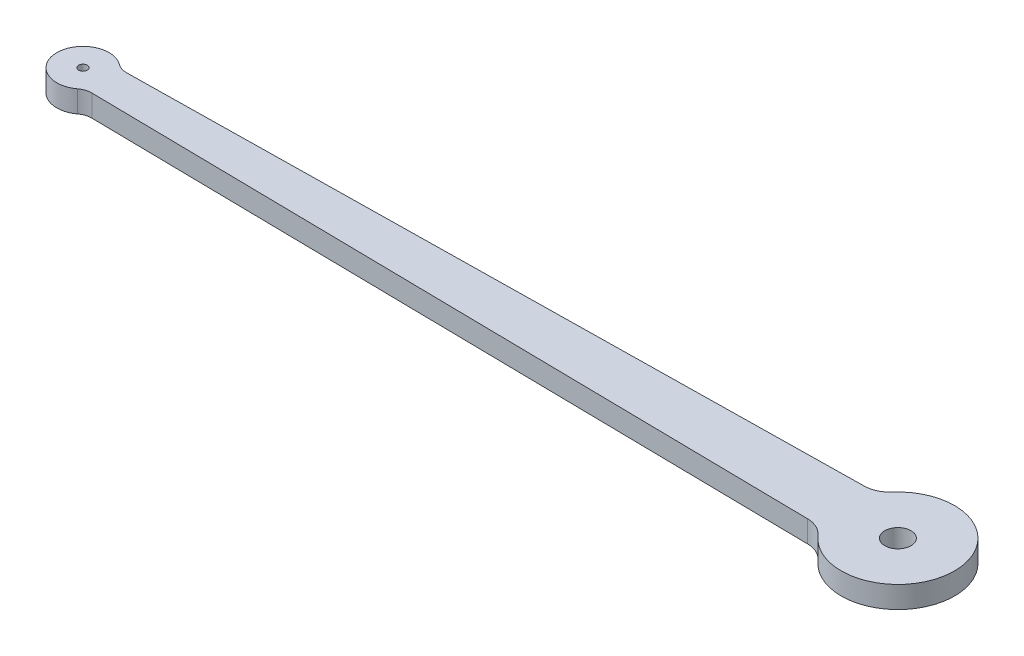
ISO-10303-21;
HEADER;
FILE_DESCRIPTION(('STEP AP214'),'2;1');
FILE_NAME('part.step','',(''),(''),'','','');
FILE_SCHEMA(('AUTOMOTIVE_DESIGN { 1 0 10303 214 1 1 1 1 }'));
ENDSEC;
DATA;
#1=APPLICATION_CONTEXT('core data for automotive mechanical design processes');
#2=APPLICATION_PROTOCOL_DEFINITION('international standard','automotive_design',2000,#1);
#3=PRODUCT_CONTEXT('',#1,'mechanical');
#4=PRODUCT('Part','Part','',(#3));
#5=PRODUCT_RELATED_PRODUCT_CATEGORY('part','',(#4));
#6=PRODUCT_DEFINITION_FORMATION('','',#4);
#7=PRODUCT_DEFINITION_CONTEXT('part definition',#1,'design');
#8=PRODUCT_DEFINITION('design','',#6,#7);
#9=PRODUCT_DEFINITION_SHAPE('','',#8);
#10=(LENGTH_UNIT() NAMED_UNIT(*) SI_UNIT(.MILLI.,.METRE.));
#11=(NAMED_UNIT(*) PLANE_ANGLE_UNIT() SI_UNIT($,.RADIAN.));
#12=(NAMED_UNIT(*) SI_UNIT($,.STERADIAN.) SOLID_ANGLE_UNIT());
#13=UNCERTAINTY_MEASURE_WITH_UNIT(LENGTH_MEASURE(1.E-05),#10,'distance_accuracy_value','');
#14=(GEOMETRIC_REPRESENTATION_CONTEXT(3) GLOBAL_UNCERTAINTY_ASSIGNED_CONTEXT((#13)) GLOBAL_UNIT_ASSIGNED_CONTEXT((#10,
#11,#12)) REPRESENTATION_CONTEXT('',''));
#15=CARTESIAN_POINT('',(0.,0.,0.));
#16=DIRECTION('',(0.,0.,1.));
#17=DIRECTION('',(1.,0.,0.));
#18=AXIS2_PLACEMENT_3D('',#15,#16,#17);
#19=CARTESIAN_POINT('',(39.5951614105319,2.5,-6.24966277159476));
#20=DIRECTION('',(0.,-1.,0.));
#21=DIRECTION('',(0.,0.,-1.));
#22=AXIS2_PLACEMENT_3D('',#19,#20,#21);
#23=CYLINDRICAL_SURFACE('',#22,3.);
#24=CARTESIAN_POINT('',(39.5951614105319,0.,-6.24966277159476));
#25=DIRECTION('',(0.,-1.,0.));
#26=DIRECTION('',(0.,0.,1.));
#27=AXIS2_PLACEMENT_3D('',#24,#25,#26);
#28=CIRCLE('',#27,3.);
#29=CARTESIAN_POINT('',(41.8545841229955,0.,-4.27608505424905));
#30=VERTEX_POINT('',#29);
#31=CARTESIAN_POINT('',(39.6401420364545,0.,-3.25));
#32=VERTEX_POINT('',#31);
#33=EDGE_CURVE('E130',#30,#32,#28,.T.);
#34=ORIENTED_EDGE('',*,*,#33,.T.);
#35=DIRECTION('',(0.,-1.,0.));
#36=VECTOR('',#35,1.);
#37=CARTESIAN_POINT('',(39.6401420364545,2.5,-3.25));
#38=LINE('',#37,#36);
#39=CARTESIAN_POINT('',(39.6401420364545,2.5,-3.25));
#40=VERTEX_POINT('',#39);
#41=EDGE_CURVE('E11',#40,#32,#38,.T.);
#42=ORIENTED_EDGE('',*,*,#41,.F.);
#43=CARTESIAN_POINT('',(39.5951614105319,2.5,-6.24966277159476));
#44=DIRECTION('',(0.,-1.,0.));
#45=DIRECTION('',(0.,0.,1.));
#46=AXIS2_PLACEMENT_3D('',#43,#44,#45);
#47=CIRCLE('',#46,3.);
#48=CARTESIAN_POINT('',(41.8545841229955,2.5,-4.27608505424905));
#49=VERTEX_POINT('',#48);
#50=EDGE_CURVE('E145',#49,#40,#47,.T.);
#51=ORIENTED_EDGE('',*,*,#50,.F.);
#52=DIRECTION('',(0.,-1.,0.));
#53=VECTOR('',#52,1.);
#54=CARTESIAN_POINT('',(41.8545841229955,2.5,-4.27608505424905));
#55=LINE('',#54,#53);
#56=EDGE_CURVE('E126',#49,#30,#55,.T.);
#57=ORIENTED_EDGE('',*,*,#56,.T.);
#58=EDGE_LOOP('',(#34,#42,#51,#57));
#59=FACE_BOUND('',#58,.T.);
#60=ADVANCED_FACE('F34',(#59),#23,.F.);
#61=CARTESIAN_POINT('',(39.6401420364545,2.5,-3.25));
#62=DIRECTION('',(0.0149935419742022,0.,0.99988759053159));
#63=DIRECTION('',(0.99988759053159,0.,-0.0149935419742022));
#64=AXIS2_PLACEMENT_3D('',#61,#62,#63);
#65=PLANE('',#64);
#66=DIRECTION('',(-0.99988759053159,0.,0.0149935419742022));
#67=VECTOR('',#66,1.);
#68=CARTESIAN_POINT('',(39.6401420364545,0.,-3.25));
#69=LINE('',#68,#67);
#70=CARTESIAN_POINT('',(-43.7197131808668,0.,-2.00000000000016));
#71=VERTEX_POINT('',#70);
#72=EDGE_CURVE('E133',#32,#71,#69,.T.);
#73=ORIENTED_EDGE('',*,*,#72,.T.);
#74=DIRECTION('',(0.,-1.,0.));
#75=VECTOR('',#74,1.);
#76=CARTESIAN_POINT('',(-43.7197131808668,2.5,-2.00000000000016));
#77=LINE('',#76,#75);
#78=CARTESIAN_POINT('',(-43.7197131808668,2.5,-2.00000000000016));
#79=VERTEX_POINT('',#78);
#80=EDGE_CURVE('E42',#79,#71,#77,.T.);
#81=ORIENTED_EDGE('',*,*,#80,.F.);
#82=DIRECTION('',(-0.99988759053159,0.,0.0149935419742022));
#83=VECTOR('',#82,1.);
#84=CARTESIAN_POINT('',(39.6401420364545,2.5,-3.25));
#85=LINE('',#84,#83);
#86=EDGE_CURVE('E93',#40,#79,#85,.T.);
#87=ORIENTED_EDGE('',*,*,#86,.F.);
#88=ORIENTED_EDGE('',*,*,#41,.T.);
#89=EDGE_LOOP('',(#73,#81,#87,#88));
#90=FACE_BOUND('',#89,.T.);
#91=ADVANCED_FACE('F213',(#90),#65,.F.);
#92=CARTESIAN_POINT('',(-43.7497002648152,2.5,-3.99977518106334));
#93=DIRECTION('',(0.,-1.,0.));
#94=DIRECTION('',(0.,0.,-1.));
#95=AXIS2_PLACEMENT_3D('',#92,#93,#94);
#96=CYLINDRICAL_SURFACE('',#95,2.);
#97=CARTESIAN_POINT('',(-43.7497002648152,0.,-3.99977518106334));
#98=DIRECTION('',(0.,-1.,0.));
#99=DIRECTION('',(0.,0.,-1.));
#100=AXIS2_PLACEMENT_3D('',#97,#98,#99);
#101=CIRCLE('',#100,2.);
#102=CARTESIAN_POINT('',(-44.9498201588891,0.,-2.399865108638));
#103=VERTEX_POINT('',#102);
#104=EDGE_CURVE('E136',#71,#103,#101,.T.);
#105=ORIENTED_EDGE('',*,*,#104,.T.);
#106=DIRECTION('',(0.,-1.,0.));
#107=VECTOR('',#106,1.);
#108=CARTESIAN_POINT('',(-44.9498201588891,2.5,-2.399865108638));
#109=LINE('',#108,#107);
#110=CARTESIAN_POINT('',(-44.9498201588891,2.5,-2.399865108638));
#111=VERTEX_POINT('',#110);
#112=EDGE_CURVE('E152',#111,#103,#109,.T.);
#113=ORIENTED_EDGE('',*,*,#112,.F.);
#114=CARTESIAN_POINT('',(-43.7497002648152,2.5,-3.99977518106334));
#115=DIRECTION('',(0.,-1.,0.));
#116=DIRECTION('',(0.,0.,-1.));
#117=AXIS2_PLACEMENT_3D('',#114,#115,#116);
#118=CIRCLE('',#117,2.);
#119=EDGE_CURVE('E160',#79,#111,#118,.T.);
#120=ORIENTED_EDGE('',*,*,#119,.F.);
#121=ORIENTED_EDGE('',*,*,#80,.T.);
#122=EDGE_LOOP('',(#105,#113,#120,#121));
#123=FACE_BOUND('',#122,.T.);
#124=ADVANCED_FACE('F158',(#123),#96,.F.);
#125=CARTESIAN_POINT('',(-46.75,2.5,0.));
#126=DIRECTION('',(0.,-1.,0.));
#127=DIRECTION('',(0.,0.,-1.));
#128=AXIS2_PLACEMENT_3D('',#125,#126,#127);
#129=CYLINDRICAL_SURFACE('',#128,3.);
#130=CARTESIAN_POINT('',(-46.75,0.,0.));
#131=DIRECTION('',(0.,1.,0.));
#132=DIRECTION('',(0.,0.,1.));
#133=AXIS2_PLACEMENT_3D('',#130,#131,#132);
#134=CIRCLE('',#133,3.);
#135=CARTESIAN_POINT('',(-44.9498201588891,0.,2.39986510863801));
#136=VERTEX_POINT('',#135);
#137=EDGE_CURVE('E138',#103,#136,#134,.T.);
#138=ORIENTED_EDGE('',*,*,#137,.T.);
#139=DIRECTION('',(0.,-1.,0.));
#140=VECTOR('',#139,1.);
#141=CARTESIAN_POINT('',(-44.9498201588891,2.5,2.39986510863801));
#142=LINE('',#141,#140);
#143=CARTESIAN_POINT('',(-44.9498201588891,2.5,2.39986510863801));
#144=VERTEX_POINT('',#143);
#145=EDGE_CURVE('E149',#144,#136,#142,.T.);
#146=ORIENTED_EDGE('',*,*,#145,.F.);
#147=CARTESIAN_POINT('',(-46.75,2.5,0.));
#148=DIRECTION('',(0.,1.,0.));
#149=DIRECTION('',(0.,0.,1.));
#150=AXIS2_PLACEMENT_3D('',#147,#148,#149);
#151=CIRCLE('',#150,3.);
#152=EDGE_CURVE('E172',#111,#144,#151,.T.);
#153=ORIENTED_EDGE('',*,*,#152,.F.);
#154=ORIENTED_EDGE('',*,*,#112,.T.);
#155=EDGE_LOOP('',(#138,#146,#153,#154));
#156=FACE_BOUND('',#155,.T.);
#157=ADVANCED_FACE('F168',(#156),#129,.T.);
#158=CARTESIAN_POINT('',(-43.7497002648152,2.5,3.99977518106334));
#159=DIRECTION('',(0.,-1.,0.));
#160=DIRECTION('',(0.,0.,-1.));
#161=AXIS2_PLACEMENT_3D('',#158,#159,#160);
#162=CYLINDRICAL_SURFACE('',#161,2.);
#163=CARTESIAN_POINT('',(-43.7497002648152,0.,3.99977518106334));
#164=DIRECTION('',(0.,-1.,0.));
#165=DIRECTION('',(0.,0.,1.));
#166=AXIS2_PLACEMENT_3D('',#163,#164,#165);
#167=CIRCLE('',#166,2.);
#168=CARTESIAN_POINT('',(-43.7197131808668,0.,2.00000000000016));
#169=VERTEX_POINT('',#168);
#170=EDGE_CURVE('E140',#136,#169,#167,.T.);
#171=ORIENTED_EDGE('',*,*,#170,.T.);
#172=DIRECTION('',(0.,-1.,0.));
#173=VECTOR('',#172,1.);
#174=CARTESIAN_POINT('',(-43.7197131808668,2.5,2.00000000000016));
#175=LINE('',#174,#173);
#176=CARTESIAN_POINT('',(-43.7197131808668,2.5,2.00000000000016));
#177=VERTEX_POINT('',#176);
#178=EDGE_CURVE('E121',#177,#169,#175,.T.);
#179=ORIENTED_EDGE('',*,*,#178,.F.);
#180=CARTESIAN_POINT('',(-43.7497002648152,2.5,3.99977518106334));
#181=DIRECTION('',(0.,-1.,0.));
#182=DIRECTION('',(0.,0.,1.));
#183=AXIS2_PLACEMENT_3D('',#180,#181,#182);
#184=CIRCLE('',#183,2.);
#185=EDGE_CURVE('E112',#144,#177,#184,.T.);
#186=ORIENTED_EDGE('',*,*,#185,.F.);
#187=ORIENTED_EDGE('',*,*,#145,.T.);
#188=EDGE_LOOP('',(#171,#179,#186,#187));
#189=FACE_BOUND('',#188,.T.);
#190=ADVANCED_FACE('F171',(#189),#162,.F.);
#191=CARTESIAN_POINT('',(39.6401420364545,2.5,3.24999999999999));
#192=DIRECTION('',(0.0149935419742021,0.,-0.99988759053159));
#193=DIRECTION('',(-0.99988759053159,0.,-0.0149935419742021));
#194=AXIS2_PLACEMENT_3D('',#191,#192,#193);
#195=PLANE('',#194);
#196=DIRECTION('',(0.99988759053159,0.,0.0149935419742021));
#197=VECTOR('',#196,1.);
#198=CARTESIAN_POINT('',(39.6401420364545,0.,3.24999999999999));
#199=LINE('',#198,#197);
#200=CARTESIAN_POINT('',(39.6401420364545,0.,3.24999999999999));
#201=VERTEX_POINT('',#200);
#202=EDGE_CURVE('E120',#169,#201,#199,.T.);
#203=ORIENTED_EDGE('',*,*,#202,.T.);
#204=DIRECTION('',(0.,-1.,0.));
#205=VECTOR('',#204,1.);
#206=CARTESIAN_POINT('',(39.6401420364545,2.5,3.24999999999999));
#207=LINE('',#206,#205);
#208=CARTESIAN_POINT('',(39.6401420364545,2.5,3.24999999999999));
#209=VERTEX_POINT('',#208);
#210=EDGE_CURVE('E117',#209,#201,#207,.T.);
#211=ORIENTED_EDGE('',*,*,#210,.F.);
#212=DIRECTION('',(0.99988759053159,0.,0.0149935419742021));
#213=VECTOR('',#212,1.);
#214=CARTESIAN_POINT('',(39.6401420364545,2.5,3.24999999999999));
#215=LINE('',#214,#213);
#216=EDGE_CURVE('E106',#177,#209,#215,.T.);
#217=ORIENTED_EDGE('',*,*,#216,.F.);
#218=ORIENTED_EDGE('',*,*,#178,.T.);
#219=EDGE_LOOP('',(#203,#211,#217,#218));
#220=FACE_BOUND('',#219,.T.);
#221=ADVANCED_FACE('F118',(#220),#195,.F.);
#222=CARTESIAN_POINT('',(39.5951614105319,2.5,6.24966277159476));
#223=DIRECTION('',(0.,-1.,0.));
#224=DIRECTION('',(0.,0.,-1.));
#225=AXIS2_PLACEMENT_3D('',#222,#223,#224);
#226=CYLINDRICAL_SURFACE('',#225,3.);
#227=CARTESIAN_POINT('',(39.5951614105319,0.,6.24966277159476));
#228=DIRECTION('',(0.,-1.,0.));
#229=DIRECTION('',(0.,0.,-1.));
#230=AXIS2_PLACEMENT_3D('',#227,#228,#229);
#231=CIRCLE('',#230,3.);
#232=CARTESIAN_POINT('',(41.8545841229955,0.,4.27608505424905));
#233=VERTEX_POINT('',#232);
#234=EDGE_CURVE('E79',#201,#233,#231,.T.);
#235=ORIENTED_EDGE('',*,*,#234,.T.);
#236=DIRECTION('',(0.,-1.,0.));
#237=VECTOR('',#236,1.);
#238=CARTESIAN_POINT('',(41.8545841229955,2.5,4.27608505424905));
#239=LINE('',#238,#237);
#240=CARTESIAN_POINT('',(41.8545841229955,2.5,4.27608505424905));
#241=VERTEX_POINT('',#240);
#242=EDGE_CURVE('E122',#241,#233,#239,.T.);
#243=ORIENTED_EDGE('',*,*,#242,.F.);
#244=CARTESIAN_POINT('',(39.5951614105319,2.5,6.24966277159476));
#245=DIRECTION('',(0.,-1.,0.));
#246=DIRECTION('',(0.,0.,-1.));
#247=AXIS2_PLACEMENT_3D('',#244,#245,#246);
#248=CIRCLE('',#247,3.);
#249=EDGE_CURVE('E110',#209,#241,#248,.T.);
#250=ORIENTED_EDGE('',*,*,#249,.F.);
#251=ORIENTED_EDGE('',*,*,#210,.T.);
#252=EDGE_LOOP('',(#235,#243,#250,#251));
#253=FACE_BOUND('',#252,.T.);
#254=ADVANCED_FACE('F124',(#253),#226,.F.);
#255=CARTESIAN_POINT('',(46.75,2.5,0.));
#256=DIRECTION('',(0.,-1.,0.));
#257=DIRECTION('',(0.,0.,-1.));
#258=AXIS2_PLACEMENT_3D('',#255,#256,#257);
#259=CYLINDRICAL_SURFACE('',#258,6.5);
#260=CARTESIAN_POINT('',(46.75,0.,0.));
#261=DIRECTION('',(0.,1.,0.));
#262=DIRECTION('',(0.,0.,1.));
#263=AXIS2_PLACEMENT_3D('',#260,#261,#262);
#264=CIRCLE('',#263,6.5);
#265=EDGE_CURVE('E85',#233,#30,#264,.T.);
#266=ORIENTED_EDGE('',*,*,#265,.T.);
#267=ORIENTED_EDGE('',*,*,#56,.F.);
#268=CARTESIAN_POINT('',(46.75,2.5,0.));
#269=DIRECTION('',(0.,1.,0.));
#270=DIRECTION('',(0.,0.,1.));
#271=AXIS2_PLACEMENT_3D('',#268,#269,#270);
#272=CIRCLE('',#271,6.5);
#273=EDGE_CURVE('E50',#241,#49,#272,.T.);
#274=ORIENTED_EDGE('',*,*,#273,.F.);
#275=ORIENTED_EDGE('',*,*,#242,.T.);
#276=EDGE_LOOP('',(#266,#267,#274,#275));
#277=FACE_BOUND('',#276,.T.);
#278=ADVANCED_FACE('F195',(#277),#259,.T.);
#279=CARTESIAN_POINT('',(39.5951614105319,2.5,-6.24966277159476));
#280=DIRECTION('',(0.,1.,0.));
#281=DIRECTION('',(0.,0.,1.));
#282=AXIS2_PLACEMENT_3D('',#279,#280,#281);
#283=PLANE('',#282);
#284=CARTESIAN_POINT('',(46.75,2.5,0.));
#285=DIRECTION('',(0.,1.,0.));
#286=DIRECTION('',(0.,0.,1.));
#287=AXIS2_PLACEMENT_3D('',#284,#285,#286);
#288=CIRCLE('',#287,1.5);
#289=CARTESIAN_POINT('',(46.75,2.5,1.5));
#290=VERTEX_POINT('',#289);
#291=EDGE_CURVE('E186',#290,#290,#288,.T.);
#292=ORIENTED_EDGE('',*,*,#291,.F.);
#293=EDGE_LOOP('',(#292));
#294=FACE_BOUND('',#293,.T.);
#295=CARTESIAN_POINT('',(-46.75,2.5,0.));
#296=DIRECTION('',(0.,1.,0.));
#297=DIRECTION('',(0.,0.,1.));
#298=AXIS2_PLACEMENT_3D('',#295,#296,#297);
#299=CIRCLE('',#298,0.499999999999999);
#300=CARTESIAN_POINT('',(-46.75,2.5,0.499999999999999));
#301=VERTEX_POINT('',#300);
#302=EDGE_CURVE('E180',#301,#301,#299,.T.);
#303=ORIENTED_EDGE('',*,*,#302,.F.);
#304=EDGE_LOOP('',(#303));
#305=FACE_BOUND('',#304,.T.);
#306=ORIENTED_EDGE('',*,*,#50,.T.);
#307=ORIENTED_EDGE('',*,*,#86,.T.);
#308=ORIENTED_EDGE('',*,*,#119,.T.);
#309=ORIENTED_EDGE('',*,*,#152,.T.);
#310=ORIENTED_EDGE('',*,*,#185,.T.);
#311=ORIENTED_EDGE('',*,*,#216,.T.);
#312=ORIENTED_EDGE('',*,*,#249,.T.);
#313=ORIENTED_EDGE('',*,*,#273,.T.);
#314=EDGE_LOOP('',(#306,#307,#308,#309,#310,#311,#312,#313));
#315=FACE_BOUND('',#314,.T.);
#316=ADVANCED_FACE('F108',(#294,#305,#315),#283,.T.);
#317=CARTESIAN_POINT('',(39.5951614105319,0.,-6.24966277159476));
#318=DIRECTION('',(0.,1.,0.));
#319=DIRECTION('',(0.,0.,1.));
#320=AXIS2_PLACEMENT_3D('',#317,#318,#319);
#321=PLANE('',#320);
#322=CARTESIAN_POINT('',(46.75,0.,0.));
#323=DIRECTION('',(0.,1.,0.));
#324=DIRECTION('',(0.,0.,1.));
#325=AXIS2_PLACEMENT_3D('',#322,#323,#324);
#326=CIRCLE('',#325,1.5);
#327=CARTESIAN_POINT('',(46.75,0.,1.5));
#328=VERTEX_POINT('',#327);
#329=EDGE_CURVE('E183',#328,#328,#326,.F.);
#330=ORIENTED_EDGE('',*,*,#329,.F.);
#331=EDGE_LOOP('',(#330));
#332=FACE_BOUND('',#331,.T.);
#333=CARTESIAN_POINT('',(-46.75,0.,0.));
#334=DIRECTION('',(0.,1.,0.));
#335=DIRECTION('',(0.,0.,1.));
#336=AXIS2_PLACEMENT_3D('',#333,#334,#335);
#337=CIRCLE('',#336,0.499999999999999);
#338=CARTESIAN_POINT('',(-46.75,0.,0.499999999999999));
#339=VERTEX_POINT('',#338);
#340=EDGE_CURVE('E134',#339,#339,#337,.F.);
#341=ORIENTED_EDGE('',*,*,#340,.F.);
#342=EDGE_LOOP('',(#341));
#343=FACE_BOUND('',#342,.T.);
#344=ORIENTED_EDGE('',*,*,#33,.F.);
#345=ORIENTED_EDGE('',*,*,#265,.F.);
#346=ORIENTED_EDGE('',*,*,#234,.F.);
#347=ORIENTED_EDGE('',*,*,#202,.F.);
#348=ORIENTED_EDGE('',*,*,#170,.F.);
#349=ORIENTED_EDGE('',*,*,#137,.F.);
#350=ORIENTED_EDGE('',*,*,#104,.F.);
#351=ORIENTED_EDGE('',*,*,#72,.F.);
#352=EDGE_LOOP('',(#344,#345,#346,#347,#348,#349,#350,#351));
#353=FACE_BOUND('',#352,.T.);
#354=ADVANCED_FACE('F164',(#332,#343,#353),#321,.F.);
#355=CARTESIAN_POINT('',(-46.75,-0.00100000000000013,0.));
#356=DIRECTION('',(0.,1.,0.));
#357=DIRECTION('',(0.,0.,1.));
#358=AXIS2_PLACEMENT_3D('',#355,#356,#357);
#359=CYLINDRICAL_SURFACE('',#358,0.499999999999999);
#360=ORIENTED_EDGE('',*,*,#302,.T.);
#361=EDGE_LOOP('',(#360));
#362=FACE_BOUND('',#361,.T.);
#363=ORIENTED_EDGE('',*,*,#340,.T.);
#364=EDGE_LOOP('',(#363));
#365=FACE_BOUND('',#364,.T.);
#366=ADVANCED_FACE('F199',(#362,#365),#359,.F.);
#367=CARTESIAN_POINT('',(46.75,-0.00100000000000013,0.));
#368=DIRECTION('',(0.,1.,0.));
#369=DIRECTION('',(0.,0.,1.));
#370=AXIS2_PLACEMENT_3D('',#367,#368,#369);
#371=CYLINDRICAL_SURFACE('',#370,1.5);
#372=ORIENTED_EDGE('',*,*,#291,.T.);
#373=EDGE_LOOP('',(#372));
#374=FACE_BOUND('',#373,.T.);
#375=ORIENTED_EDGE('',*,*,#329,.T.);
#376=EDGE_LOOP('',(#375));
#377=FACE_BOUND('',#376,.T.);
#378=ADVANCED_FACE('F190',(#374,#377),#371,.F.);
#379=CLOSED_SHELL('',(#60,#91,#124,#157,#190,#221,#254,#278,#316,#354,#366,#378));
#380=MANIFOLD_SOLID_BREP('B2',#379);
#381=ADVANCED_BREP_SHAPE_REPRESENTATION('',(#18,#380),#14);
#382=SHAPE_DEFINITION_REPRESENTATION(#9,#381);
ENDSEC;
END-ISO-10303-21;
